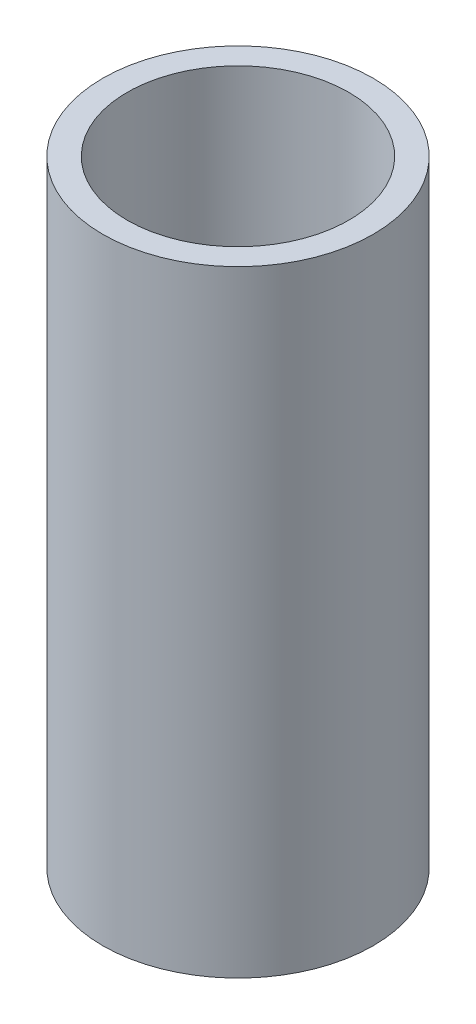
ISO-10303-21;
HEADER;
FILE_DESCRIPTION(('STEP AP214'),'2;1');
FILE_NAME('part.step','',(''),(''),'','','');
FILE_SCHEMA(('AUTOMOTIVE_DESIGN { 1 0 10303 214 1 1 1 1 }'));
ENDSEC;
DATA;
#1=APPLICATION_CONTEXT('core data for automotive mechanical design processes');
#2=APPLICATION_PROTOCOL_DEFINITION('international standard','automotive_design',2000,#1);
#3=PRODUCT_CONTEXT('',#1,'mechanical');
#4=PRODUCT('Part','Part','',(#3));
#5=PRODUCT_RELATED_PRODUCT_CATEGORY('part','',(#4));
#6=PRODUCT_DEFINITION_FORMATION('','',#4);
#7=PRODUCT_DEFINITION_CONTEXT('part definition',#1,'design');
#8=PRODUCT_DEFINITION('design','',#6,#7);
#9=PRODUCT_DEFINITION_SHAPE('','',#8);
#10=(LENGTH_UNIT() NAMED_UNIT(*) SI_UNIT(.MILLI.,.METRE.));
#11=(NAMED_UNIT(*) PLANE_ANGLE_UNIT() SI_UNIT($,.RADIAN.));
#12=(NAMED_UNIT(*) SI_UNIT($,.STERADIAN.) SOLID_ANGLE_UNIT());
#13=UNCERTAINTY_MEASURE_WITH_UNIT(LENGTH_MEASURE(1.E-05),#10,'distance_accuracy_value','');
#14=(GEOMETRIC_REPRESENTATION_CONTEXT(3) GLOBAL_UNCERTAINTY_ASSIGNED_CONTEXT((#13)) GLOBAL_UNIT_ASSIGNED_CONTEXT((#10,
#11,#12)) REPRESENTATION_CONTEXT('',''));
#15=CARTESIAN_POINT('',(0.,0.,0.));
#16=DIRECTION('',(0.,0.,1.));
#17=DIRECTION('',(1.,0.,0.));
#18=AXIS2_PLACEMENT_3D('',#15,#16,#17);
#19=CARTESIAN_POINT('',(0.,79.7500846524608,0.));
#20=DIRECTION('',(0.,-1.,0.));
#21=DIRECTION('',(0.,0.,-1.));
#22=AXIS2_PLACEMENT_3D('',#19,#20,#21);
#23=CYLINDRICAL_SURFACE('',#22,17.5);
#24=CARTESIAN_POINT('',(0.,79.7500846524608,0.));
#25=DIRECTION('',(0.,1.,0.));
#26=DIRECTION('',(0.,0.,1.));
#27=AXIS2_PLACEMENT_3D('',#24,#25,#26);
#28=CIRCLE('',#27,17.5);
#29=CARTESIAN_POINT('',(0.,79.7500846524608,-17.5));
#30=VERTEX_POINT('',#29);
#31=EDGE_CURVE('E10',#30,#30,#28,.T.);
#32=CARTESIAN_POINT('',(0.,0.,0.));
#33=DIRECTION('',(0.,1.,0.));
#34=DIRECTION('',(0.,0.,1.));
#35=AXIS2_PLACEMENT_3D('',#32,#33,#34);
#36=CIRCLE('',#35,17.5);
#37=CARTESIAN_POINT('',(0.,0.,-17.5));
#38=VERTEX_POINT('',#37);
#39=EDGE_CURVE('E37',#38,#38,#36,.T.);
#40=CARTESIAN_POINT('',(0.,79.7500846524608,-17.5));
#41=CARTESIAN_POINT('',(0.,78.9193546039976,-17.5));
#42=CARTESIAN_POINT('',(0.,78.0886245555345,-17.5));
#43=CARTESIAN_POINT('',(0.,76.4271644586082,-17.5));
#44=CARTESIAN_POINT('',(0.,75.5964344101451,-17.5));
#45=CARTESIAN_POINT('',(0.,73.9349743132188,-17.5));
#46=CARTESIAN_POINT('',(0.,73.1042442647557,-17.5));
#47=CARTESIAN_POINT('',(0.,71.4427841678294,-17.5));
#48=CARTESIAN_POINT('',(0.,70.6120541193663,-17.5));
#49=CARTESIAN_POINT('',(0.,68.95059402244,-17.5));
#50=CARTESIAN_POINT('',(0.,68.1198639739769,-17.5));
#51=CARTESIAN_POINT('',(0.,66.4584038770506,-17.5));
#52=CARTESIAN_POINT('',(0.,65.6276738285875,-17.5));
#53=CARTESIAN_POINT('',(0.,63.9662137316612,-17.5));
#54=CARTESIAN_POINT('',(0.,63.1354836831981,-17.5));
#55=CARTESIAN_POINT('',(0.,61.4740235862718,-17.5));
#56=CARTESIAN_POINT('',(0.,60.6432935378087,-17.5));
#57=CARTESIAN_POINT('',(0.,58.9818334408824,-17.5));
#58=CARTESIAN_POINT('',(0.,58.1511033924193,-17.5));
#59=CARTESIAN_POINT('',(0.,56.489643295493,-17.5));
#60=CARTESIAN_POINT('',(0.,55.6589132470299,-17.5));
#61=CARTESIAN_POINT('',(0.,53.9974531501036,-17.5));
#62=CARTESIAN_POINT('',(0.,53.1667231016405,-17.5));
#63=CARTESIAN_POINT('',(0.,51.5052630047142,-17.5));
#64=CARTESIAN_POINT('',(0.,50.6745329562511,-17.5));
#65=CARTESIAN_POINT('',(0.,49.0130728593248,-17.5));
#66=CARTESIAN_POINT('',(0.,48.1823428108617,-17.5));
#67=CARTESIAN_POINT('',(0.,46.5208827139354,-17.5));
#68=CARTESIAN_POINT('',(0.,45.6901526654723,-17.5));
#69=CARTESIAN_POINT('',(0.,44.028692568546,-17.5));
#70=CARTESIAN_POINT('',(0.,43.1979625200829,-17.5));
#71=CARTESIAN_POINT('',(0.,41.5365024231566,-17.5));
#72=CARTESIAN_POINT('',(0.,40.7057723746935,-17.5));
#73=CARTESIAN_POINT('',(0.,39.0443122777672,-17.5));
#74=CARTESIAN_POINT('',(0.,38.2135822293041,-17.5));
#75=CARTESIAN_POINT('',(0.,36.5521221323778,-17.5));
#76=CARTESIAN_POINT('',(0.,35.7213920839147,-17.5));
#77=CARTESIAN_POINT('',(0.,34.0599319869884,-17.5));
#78=CARTESIAN_POINT('',(0.,33.2292019385253,-17.5));
#79=CARTESIAN_POINT('',(0.,31.567741841599,-17.5));
#80=CARTESIAN_POINT('',(0.,30.7370117931359,-17.5));
#81=CARTESIAN_POINT('',(0.,29.0755516962096,-17.5));
#82=CARTESIAN_POINT('',(0.,28.2448216477465,-17.5));
#83=CARTESIAN_POINT('',(0.,26.5833615508202,-17.5));
#84=CARTESIAN_POINT('',(0.,25.7526315023571,-17.5));
#85=CARTESIAN_POINT('',(0.,24.0911714054308,-17.5));
#86=CARTESIAN_POINT('',(0.,23.2604413569677,-17.5));
#87=CARTESIAN_POINT('',(0.,21.5989812600414,-17.5));
#88=CARTESIAN_POINT('',(0.,20.7682512115783,-17.5));
#89=CARTESIAN_POINT('',(0.,19.106791114652,-17.5));
#90=CARTESIAN_POINT('',(0.,18.2760610661889,-17.5));
#91=CARTESIAN_POINT('',(0.,16.6146009692627,-17.5));
#92=CARTESIAN_POINT('',(0.,15.7838709207995,-17.5));
#93=CARTESIAN_POINT('',(0.,14.1224108238733,-17.5));
#94=CARTESIAN_POINT('',(0.,13.2916807754101,-17.5));
#95=CARTESIAN_POINT('',(0.,11.6302206784839,-17.5));
#96=CARTESIAN_POINT('',(0.,10.7994906300207,-17.5));
#97=CARTESIAN_POINT('',(0.,9.13803053309447,-17.5));
#98=CARTESIAN_POINT('',(0.,8.30730048463133,-17.5));
#99=CARTESIAN_POINT('',(0.,6.64584038770507,-17.5));
#100=CARTESIAN_POINT('',(0.,5.81511033924193,-17.5));
#101=CARTESIAN_POINT('',(0.,4.15365024231567,-17.5));
#102=CARTESIAN_POINT('',(0.,3.32292019385253,-17.5));
#103=CARTESIAN_POINT('',(0.,1.66146009692627,-17.5));
#104=CARTESIAN_POINT('',(0.,0.830730048463134,-17.5));
#105=CARTESIAN_POINT('',(0.,0.,-17.5));
#106=B_SPLINE_CURVE_WITH_KNOTS('',3,(#40,#41,#42,#43,#44,#45,#46,#47,#48,#49,#50,#51,#52,#53,
#54,#55,#56,#57,#58,#59,#60,#61,#62,#63,#64,#65,#66,#67,#68,#69,#70,#71,#72,#73,#74,#75,#76,#77,
#78,#79,#80,#81,#82,#83,#84,#85,#86,#87,#88,#89,#90,#91,#92,#93,#94,#95,#96,#97,#98,#99,#100,
#101,#102,#103,#104,#105),.UNSPECIFIED.,.F.,.F.,(4,2,2,2,2,2,2,2,2,2,2,2,2,2,2,2,2,2,2,2,2,2,2,
2,2,2,2,2,2,2,2,2,4),(0.,2.4921901453894,4.9843802907788,7.4765704361682,9.9687605815576,
12.460950726947,14.9531408723364,17.4453310177258,19.9375211631152,22.4297113085046,
24.921901453894,27.4140915992834,29.9062817446728,32.3984718900622,34.8906620354516,
37.382852180841,39.8750423262304,42.3672324716198,44.8594226170092,47.3516127623986,
49.843802907788,52.3359930531774,54.8281831985668,57.3203733439562,59.8125634893456,
62.304753634735,64.7969437801244,67.2891339255138,69.7813240709032,72.2735142162926,
74.765704361682,77.2578945070714,79.7500846524608),.UNSPECIFIED.);
#107=EDGE_CURVE('BSEAM40',#30,#38,#106,.T.);
#108=ORIENTED_EDGE('',*,*,#31,.F.);
#109=ORIENTED_EDGE('',*,*,#39,.T.);
#110=ORIENTED_EDGE('',*,*,#107,.T.);
#111=ORIENTED_EDGE('',*,*,#107,.F.);
#112=EDGE_LOOP('',(#108,#110,#109,#111));
#113=FACE_BOUND('',#112,.T.);
#114=ADVANCED_FACE('F40',(#113),#23,.T.);
#115=CARTESIAN_POINT('',(0.,79.7500846524608,0.));
#116=DIRECTION('',(0.,1.,0.));
#117=DIRECTION('',(0.,0.,1.));
#118=AXIS2_PLACEMENT_3D('',#115,#116,#117);
#119=PLANE('',#118);
#120=CARTESIAN_POINT('',(0.,79.7500846524608,0.));
#121=DIRECTION('',(0.,1.,0.));
#122=DIRECTION('',(0.,0.,1.));
#123=AXIS2_PLACEMENT_3D('',#120,#121,#122);
#124=CIRCLE('',#123,14.3442903212041);
#125=CARTESIAN_POINT('',(0.,79.7500846524608,-14.3442903212041));
#126=VERTEX_POINT('',#125);
#127=EDGE_CURVE('E50',#126,#126,#124,.T.);
#128=ORIENTED_EDGE('',*,*,#127,.F.);
#129=EDGE_LOOP('',(#128));
#130=FACE_BOUND('',#129,.T.);
#131=ORIENTED_EDGE('',*,*,#31,.T.);
#132=EDGE_LOOP('',(#131));
#133=FACE_BOUND('',#132,.T.);
#134=ADVANCED_FACE('F59',(#130,#133),#119,.T.);
#135=CARTESIAN_POINT('',(0.,0.,0.));
#136=DIRECTION('',(0.,1.,0.));
#137=DIRECTION('',(0.,0.,1.));
#138=AXIS2_PLACEMENT_3D('',#135,#136,#137);
#139=PLANE('',#138);
#140=CARTESIAN_POINT('',(0.,0.,0.));
#141=DIRECTION('',(0.,1.,0.));
#142=DIRECTION('',(0.,0.,1.));
#143=AXIS2_PLACEMENT_3D('',#140,#141,#142);
#144=CIRCLE('',#143,14.3442903212041);
#145=CARTESIAN_POINT('',(0.,0.,-14.3442903212041));
#146=VERTEX_POINT('',#145);
#147=EDGE_CURVE('E47',#146,#146,#144,.T.);
#148=ORIENTED_EDGE('',*,*,#147,.T.);
#149=EDGE_LOOP('',(#148));
#150=FACE_BOUND('',#149,.T.);
#151=ORIENTED_EDGE('',*,*,#39,.F.);
#152=EDGE_LOOP('',(#151));
#153=FACE_BOUND('',#152,.T.);
#154=ADVANCED_FACE('F58',(#150,#153),#139,.F.);
#155=CARTESIAN_POINT('',(0.,79.7500846524608,0.));
#156=DIRECTION('',(0.,-1.,0.));
#157=DIRECTION('',(0.,0.,-1.));
#158=AXIS2_PLACEMENT_3D('',#155,#156,#157);
#159=CYLINDRICAL_SURFACE('',#158,14.3442903212041);
#160=CARTESIAN_POINT('',(0.,79.7500846524608,-14.3442903212041));
#161=CARTESIAN_POINT('',(0.,78.9193546039976,-14.3442903212041));
#162=CARTESIAN_POINT('',(0.,78.0886245555345,-14.3442903212041));
#163=CARTESIAN_POINT('',(0.,76.4271644586082,-14.3442903212041));
#164=CARTESIAN_POINT('',(0.,75.5964344101451,-14.3442903212041));
#165=CARTESIAN_POINT('',(0.,73.9349743132188,-14.3442903212041));
#166=CARTESIAN_POINT('',(0.,73.1042442647557,-14.3442903212041));
#167=CARTESIAN_POINT('',(0.,71.4427841678294,-14.3442903212041));
#168=CARTESIAN_POINT('',(0.,70.6120541193663,-14.3442903212041));
#169=CARTESIAN_POINT('',(0.,68.95059402244,-14.3442903212041));
#170=CARTESIAN_POINT('',(0.,68.1198639739769,-14.3442903212041));
#171=CARTESIAN_POINT('',(0.,66.4584038770506,-14.3442903212041));
#172=CARTESIAN_POINT('',(0.,65.6276738285875,-14.3442903212041));
#173=CARTESIAN_POINT('',(0.,63.9662137316612,-14.3442903212041));
#174=CARTESIAN_POINT('',(0.,63.1354836831981,-14.3442903212041));
#175=CARTESIAN_POINT('',(0.,61.4740235862718,-14.3442903212041));
#176=CARTESIAN_POINT('',(0.,60.6432935378087,-14.3442903212041));
#177=CARTESIAN_POINT('',(0.,58.9818334408824,-14.3442903212041));
#178=CARTESIAN_POINT('',(0.,58.1511033924193,-14.3442903212041));
#179=CARTESIAN_POINT('',(0.,56.489643295493,-14.3442903212041));
#180=CARTESIAN_POINT('',(0.,55.6589132470299,-14.3442903212041));
#181=CARTESIAN_POINT('',(0.,53.9974531501036,-14.3442903212041));
#182=CARTESIAN_POINT('',(0.,53.1667231016405,-14.3442903212041));
#183=CARTESIAN_POINT('',(0.,51.5052630047142,-14.3442903212041));
#184=CARTESIAN_POINT('',(0.,50.6745329562511,-14.3442903212041));
#185=CARTESIAN_POINT('',(0.,49.0130728593248,-14.3442903212041));
#186=CARTESIAN_POINT('',(0.,48.1823428108617,-14.3442903212041));
#187=CARTESIAN_POINT('',(0.,46.5208827139354,-14.3442903212041));
#188=CARTESIAN_POINT('',(0.,45.6901526654723,-14.3442903212041));
#189=CARTESIAN_POINT('',(0.,44.028692568546,-14.3442903212041));
#190=CARTESIAN_POINT('',(0.,43.1979625200829,-14.3442903212041));
#191=CARTESIAN_POINT('',(0.,41.5365024231566,-14.3442903212041));
#192=CARTESIAN_POINT('',(0.,40.7057723746935,-14.3442903212041));
#193=CARTESIAN_POINT('',(0.,39.0443122777672,-14.3442903212041));
#194=CARTESIAN_POINT('',(0.,38.2135822293041,-14.3442903212041));
#195=CARTESIAN_POINT('',(0.,36.5521221323778,-14.3442903212041));
#196=CARTESIAN_POINT('',(0.,35.7213920839147,-14.3442903212041));
#197=CARTESIAN_POINT('',(0.,34.0599319869884,-14.3442903212041));
#198=CARTESIAN_POINT('',(0.,33.2292019385253,-14.3442903212041));
#199=CARTESIAN_POINT('',(0.,31.567741841599,-14.3442903212041));
#200=CARTESIAN_POINT('',(0.,30.7370117931359,-14.3442903212041));
#201=CARTESIAN_POINT('',(0.,29.0755516962096,-14.3442903212041));
#202=CARTESIAN_POINT('',(0.,28.2448216477465,-14.3442903212041));
#203=CARTESIAN_POINT('',(0.,26.5833615508202,-14.3442903212041));
#204=CARTESIAN_POINT('',(0.,25.7526315023571,-14.3442903212041));
#205=CARTESIAN_POINT('',(0.,24.0911714054308,-14.3442903212041));
#206=CARTESIAN_POINT('',(0.,23.2604413569677,-14.3442903212041));
#207=CARTESIAN_POINT('',(0.,21.5989812600414,-14.3442903212041));
#208=CARTESIAN_POINT('',(0.,20.7682512115783,-14.3442903212041));
#209=CARTESIAN_POINT('',(0.,19.106791114652,-14.3442903212041));
#210=CARTESIAN_POINT('',(0.,18.2760610661889,-14.3442903212041));
#211=CARTESIAN_POINT('',(0.,16.6146009692627,-14.3442903212041));
#212=CARTESIAN_POINT('',(0.,15.7838709207995,-14.3442903212041));
#213=CARTESIAN_POINT('',(0.,14.1224108238733,-14.3442903212041));
#214=CARTESIAN_POINT('',(0.,13.2916807754101,-14.3442903212041));
#215=CARTESIAN_POINT('',(0.,11.6302206784839,-14.3442903212041));
#216=CARTESIAN_POINT('',(0.,10.7994906300207,-14.3442903212041));
#217=CARTESIAN_POINT('',(0.,9.13803053309447,-14.3442903212041));
#218=CARTESIAN_POINT('',(0.,8.30730048463133,-14.3442903212041));
#219=CARTESIAN_POINT('',(0.,6.64584038770507,-14.3442903212041));
#220=CARTESIAN_POINT('',(0.,5.81511033924193,-14.3442903212041));
#221=CARTESIAN_POINT('',(0.,4.15365024231567,-14.3442903212041));
#222=CARTESIAN_POINT('',(0.,3.32292019385253,-14.3442903212041));
#223=CARTESIAN_POINT('',(0.,1.66146009692627,-14.3442903212041));
#224=CARTESIAN_POINT('',(0.,0.830730048463134,-14.3442903212041));
#225=CARTESIAN_POINT('',(0.,0.,-14.3442903212041));
#226=B_SPLINE_CURVE_WITH_KNOTS('',3,(#160,#161,#162,#163,#164,#165,#166,#167,#168,#169,#170,
#171,#172,#173,#174,#175,#176,#177,#178,#179,#180,#181,#182,#183,#184,#185,#186,#187,#188,#189,
#190,#191,#192,#193,#194,#195,#196,#197,#198,#199,#200,#201,#202,#203,#204,#205,#206,#207,#208,
#209,#210,#211,#212,#213,#214,#215,#216,#217,#218,#219,#220,#221,#222,#223,#224,#225),
.UNSPECIFIED.,.F.,.F.,(4,2,2,2,2,2,2,2,2,2,2,2,2,2,2,2,2,2,2,2,2,2,2,2,2,2,2,2,2,2,2,2,4),(0.,
2.4921901453894,4.9843802907788,7.4765704361682,9.9687605815576,12.460950726947,
14.9531408723364,17.4453310177258,19.9375211631152,22.4297113085046,24.921901453894,
27.4140915992834,29.9062817446728,32.3984718900622,34.8906620354516,37.382852180841,
39.8750423262304,42.3672324716198,44.8594226170092,47.3516127623986,49.843802907788,
52.3359930531774,54.8281831985668,57.3203733439562,59.8125634893456,62.304753634735,
64.7969437801244,67.2891339255138,69.7813240709032,72.2735142162926,74.765704361682,
77.2578945070714,79.7500846524608),.UNSPECIFIED.);
#227=EDGE_CURVE('BSEAM54',#126,#146,#226,.T.);
#228=ORIENTED_EDGE('',*,*,#127,.T.);
#229=ORIENTED_EDGE('',*,*,#147,.F.);
#230=ORIENTED_EDGE('',*,*,#227,.T.);
#231=ORIENTED_EDGE('',*,*,#227,.F.);
#232=EDGE_LOOP('',(#228,#230,#229,#231));
#233=FACE_BOUND('',#232,.T.);
#234=ADVANCED_FACE('F54',(#233),#159,.F.);
#235=CLOSED_SHELL('',(#114,#134,#154,#234));
#236=MANIFOLD_SOLID_BREP('B2',#235);
#237=ADVANCED_BREP_SHAPE_REPRESENTATION('',(#18,#236),#14);
#238=SHAPE_DEFINITION_REPRESENTATION(#9,#237);
ENDSEC;
END-ISO-10303-21;
